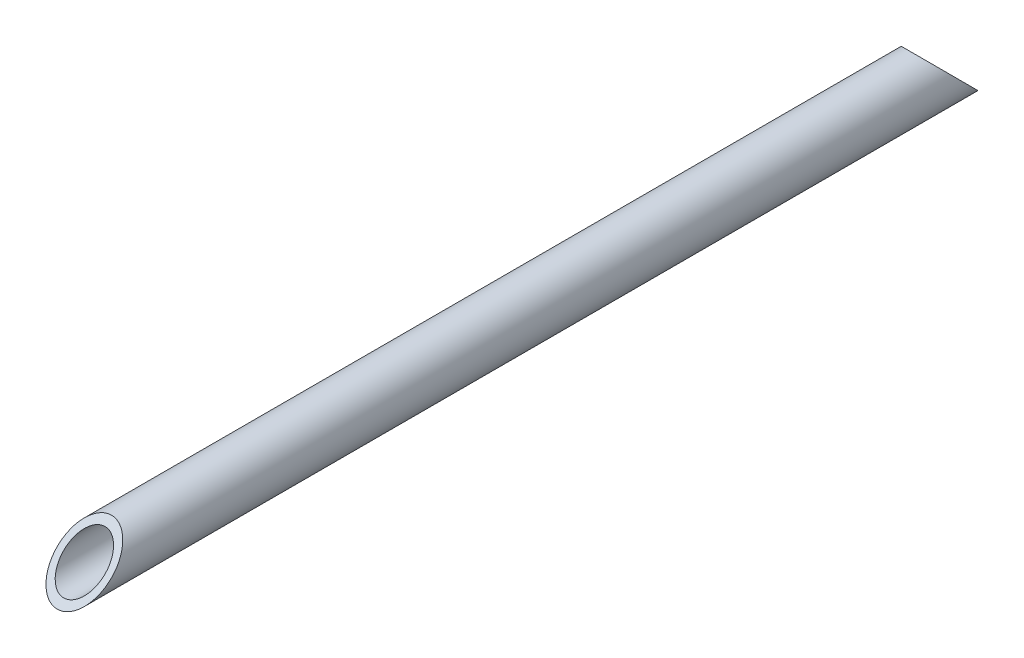
ISO-10303-21;
HEADER;
FILE_DESCRIPTION(('STEP AP214'),'2;1');
FILE_NAME('part.step','',(''),(''),'','','');
FILE_SCHEMA(('AUTOMOTIVE_DESIGN { 1 0 10303 214 1 1 1 1 }'));
ENDSEC;
DATA;
#1=APPLICATION_CONTEXT('core data for automotive mechanical design processes');
#2=APPLICATION_PROTOCOL_DEFINITION('international standard','automotive_design',2000,#1);
#3=PRODUCT_CONTEXT('',#1,'mechanical');
#4=PRODUCT('Part','Part','',(#3));
#5=PRODUCT_RELATED_PRODUCT_CATEGORY('part','',(#4));
#6=PRODUCT_DEFINITION_FORMATION('','',#4);
#7=PRODUCT_DEFINITION_CONTEXT('part definition',#1,'design');
#8=PRODUCT_DEFINITION('design','',#6,#7);
#9=PRODUCT_DEFINITION_SHAPE('','',#8);
#10=(LENGTH_UNIT() NAMED_UNIT(*) SI_UNIT(.MILLI.,.METRE.));
#11=(NAMED_UNIT(*) PLANE_ANGLE_UNIT() SI_UNIT($,.RADIAN.));
#12=(NAMED_UNIT(*) SI_UNIT($,.STERADIAN.) SOLID_ANGLE_UNIT());
#13=UNCERTAINTY_MEASURE_WITH_UNIT(LENGTH_MEASURE(1.E-05),#10,'distance_accuracy_value','');
#14=(GEOMETRIC_REPRESENTATION_CONTEXT(3) GLOBAL_UNCERTAINTY_ASSIGNED_CONTEXT((#13)) GLOBAL_UNIT_ASSIGNED_CONTEXT((#10,
#11,#12)) REPRESENTATION_CONTEXT('',''));
#15=CARTESIAN_POINT('',(0.,0.,0.));
#16=DIRECTION('',(0.,0.,1.));
#17=DIRECTION('',(1.,0.,0.));
#18=AXIS2_PLACEMENT_3D('',#15,#16,#17);
#19=CARTESIAN_POINT('',(0.,0.,200.));
#20=DIRECTION('',(0.,0.,-1.));
#21=DIRECTION('',(-1.,0.,0.));
#22=AXIS2_PLACEMENT_3D('',#19,#20,#21);
#23=CYLINDRICAL_SURFACE('',#22,9.65);
#24=CARTESIAN_POINT('',(-1.68322387278375E-13,0.,-200.000000000003));
#25=DIRECTION('',(0.,0.707106781186547,-0.707106781186548));
#26=DIRECTION('',(0.,-0.707106781186548,-0.707106781186547));
#27=AXIS2_PLACEMENT_3D('',#24,#25,#26);
#28=ELLIPSE('',#27,13.6471608769004,9.65);
#29=CARTESIAN_POINT('',(-1.76443942464556E-13,-9.65000000000001,-209.650000000003));
#30=VERTEX_POINT('',#29);
#31=EDGE_CURVE('E55',#30,#30,#28,.T.);
#32=ORIENTED_EDGE('',*,*,#31,.T.);
#33=EDGE_LOOP('',(#32));
#34=FACE_BOUND('',#33,.T.);
#35=CARTESIAN_POINT('',(0.,0.,200.));
#36=DIRECTION('',(0.,0.707106781186551,0.707106781186544));
#37=DIRECTION('',(0.,0.707106781186544,-0.707106781186551));
#38=AXIS2_PLACEMENT_3D('',#35,#36,#37);
#39=ELLIPSE('',#38,13.6471608769004,9.65);
#40=CARTESIAN_POINT('',(0.,9.65,190.35));
#41=VERTEX_POINT('',#40);
#42=EDGE_CURVE('E42',#41,#41,#39,.T.);
#43=ORIENTED_EDGE('',*,*,#42,.T.);
#44=EDGE_LOOP('',(#43));
#45=FACE_BOUND('',#44,.T.);
#46=ADVANCED_FACE('F38',(#34,#45),#23,.F.);
#47=CARTESIAN_POINT('',(0.,0.,200.));
#48=DIRECTION('',(0.,0.,-1.));
#49=DIRECTION('',(-1.,0.,0.));
#50=AXIS2_PLACEMENT_3D('',#47,#48,#49);
#51=CYLINDRICAL_SURFACE('',#50,12.7);
#52=CARTESIAN_POINT('',(-1.68322387278375E-13,0.,-200.000000000003));
#53=DIRECTION('',(0.,0.707106781186547,-0.707106781186548));
#54=DIRECTION('',(0.,-0.707106781186548,-0.707106781186547));
#55=AXIS2_PLACEMENT_3D('',#52,#53,#54);
#56=ELLIPSE('',#55,17.9605122421383,12.7);
#57=CARTESIAN_POINT('',(-1.79010858870551E-13,-12.7,-212.700000000003));
#58=VERTEX_POINT('',#57);
#59=EDGE_CURVE('E47',#58,#58,#56,.T.);
#60=ORIENTED_EDGE('',*,*,#59,.F.);
#61=EDGE_LOOP('',(#60));
#62=FACE_BOUND('',#61,.T.);
#63=CARTESIAN_POINT('',(0.,0.,200.));
#64=DIRECTION('',(0.,0.707106781186551,0.707106781186544));
#65=DIRECTION('',(0.,0.707106781186544,-0.707106781186551));
#66=AXIS2_PLACEMENT_3D('',#63,#64,#65);
#67=ELLIPSE('',#66,17.9605122421384,12.7);
#68=CARTESIAN_POINT('',(0.,12.7,187.3));
#69=VERTEX_POINT('',#68);
#70=EDGE_CURVE('E10',#69,#69,#67,.T.);
#71=ORIENTED_EDGE('',*,*,#70,.F.);
#72=EDGE_LOOP('',(#71));
#73=FACE_BOUND('',#72,.T.);
#74=ADVANCED_FACE('F73',(#62,#73),#51,.T.);
#75=CARTESIAN_POINT('',(-1.67164090169531E-13,0.,-200.000000000003));
#76=DIRECTION('',(0.,0.707106781186547,-0.707106781186548));
#77=DIRECTION('',(0.,0.707106781186548,0.707106781186547));
#78=AXIS2_PLACEMENT_3D('',#75,#76,#77);
#79=PLANE('',#78);
#80=ORIENTED_EDGE('',*,*,#31,.F.);
#81=EDGE_LOOP('',(#80));
#82=FACE_BOUND('',#81,.T.);
#83=ORIENTED_EDGE('',*,*,#59,.T.);
#84=EDGE_LOOP('',(#83));
#85=FACE_BOUND('',#84,.T.);
#86=ADVANCED_FACE('F68',(#82,#85),#79,.T.);
#87=CARTESIAN_POINT('',(0.,0.,200.));
#88=DIRECTION('',(0.,0.707106781186551,0.707106781186544));
#89=DIRECTION('',(0.,-0.707106781186544,0.707106781186551));
#90=AXIS2_PLACEMENT_3D('',#87,#88,#89);
#91=PLANE('',#90);
#92=ORIENTED_EDGE('',*,*,#42,.F.);
#93=EDGE_LOOP('',(#92));
#94=FACE_BOUND('',#93,.T.);
#95=ORIENTED_EDGE('',*,*,#70,.T.);
#96=EDGE_LOOP('',(#95));
#97=FACE_BOUND('',#96,.T.);
#98=ADVANCED_FACE('F40',(#94,#97),#91,.T.);
#99=CLOSED_SHELL('',(#46,#74,#86,#98));
#100=MANIFOLD_SOLID_BREP('B2',#99);
#101=ADVANCED_BREP_SHAPE_REPRESENTATION('',(#18,#100),#14);
#102=SHAPE_DEFINITION_REPRESENTATION(#9,#101);
ENDSEC;
END-ISO-10303-21;
